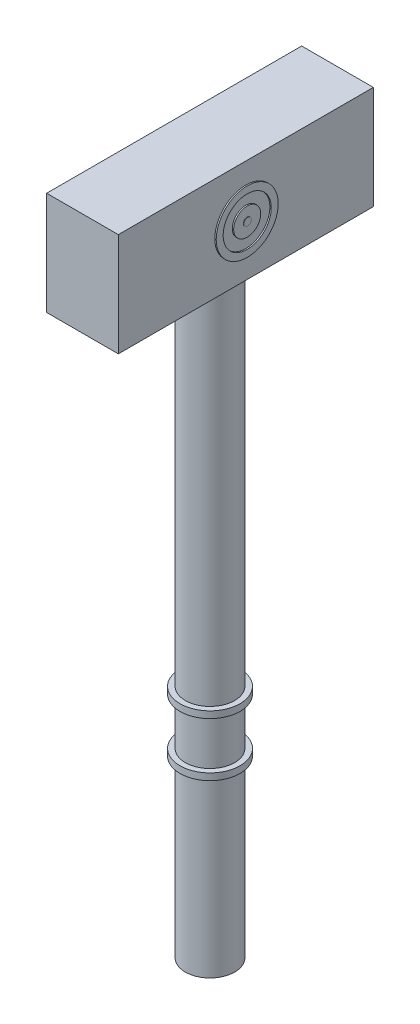
ISO-10303-21;
HEADER;
FILE_DESCRIPTION(('STEP AP214'),'2;1');
FILE_NAME('part.step','',(''),(''),'','','');
FILE_SCHEMA(('AUTOMOTIVE_DESIGN { 1 0 10303 214 1 1 1 1 }'));
ENDSEC;
DATA;
#1=APPLICATION_CONTEXT('core data for automotive mechanical design processes');
#2=APPLICATION_PROTOCOL_DEFINITION('international standard','automotive_design',2000,#1);
#3=PRODUCT_CONTEXT('',#1,'mechanical');
#4=PRODUCT('Part','Part','',(#3));
#5=PRODUCT_RELATED_PRODUCT_CATEGORY('part','',(#4));
#6=PRODUCT_DEFINITION_FORMATION('','',#4);
#7=PRODUCT_DEFINITION_CONTEXT('part definition',#1,'design');
#8=PRODUCT_DEFINITION('design','',#6,#7);
#9=PRODUCT_DEFINITION_SHAPE('','',#8);
#10=(LENGTH_UNIT() NAMED_UNIT(*) SI_UNIT(.MILLI.,.METRE.));
#11=(NAMED_UNIT(*) PLANE_ANGLE_UNIT() SI_UNIT($,.RADIAN.));
#12=(NAMED_UNIT(*) SI_UNIT($,.STERADIAN.) SOLID_ANGLE_UNIT());
#13=UNCERTAINTY_MEASURE_WITH_UNIT(LENGTH_MEASURE(1.E-05),#10,'distance_accuracy_value','');
#14=(GEOMETRIC_REPRESENTATION_CONTEXT(3) GLOBAL_UNCERTAINTY_ASSIGNED_CONTEXT((#13)) GLOBAL_UNIT_ASSIGNED_CONTEXT((#10,
#11,#12)) REPRESENTATION_CONTEXT('',''));
#15=CARTESIAN_POINT('',(0.,0.,0.));
#16=DIRECTION('',(0.,0.,1.));
#17=DIRECTION('',(1.,0.,0.));
#18=AXIS2_PLACEMENT_3D('',#15,#16,#17);
#19=CARTESIAN_POINT('',(0.,91.,0.));
#20=DIRECTION('',(0.,-1.,0.));
#21=DIRECTION('',(0.,0.,-1.));
#22=AXIS2_PLACEMENT_3D('',#19,#20,#21);
#23=CYLINDRICAL_SURFACE('',#22,3.675);
#24=CARTESIAN_POINT('',(0.,28.0000000004,0.));
#25=DIRECTION('',(0.,1.,0.));
#26=DIRECTION('',(0.,0.,1.));
#27=AXIS2_PLACEMENT_3D('',#24,#25,#26);
#28=CIRCLE('',#27,3.675);
#29=CARTESIAN_POINT('',(0.,28.0000000004,3.675));
#30=VERTEX_POINT('',#29);
#31=EDGE_CURVE('E122',#30,#30,#28,.T.);
#32=ORIENTED_EDGE('',*,*,#31,.T.);
#33=EDGE_LOOP('',(#32));
#34=FACE_BOUND('',#33,.T.);
#35=CARTESIAN_POINT('',(0.,35.0000000004,0.));
#36=DIRECTION('',(0.,1.,0.));
#37=DIRECTION('',(0.,0.,1.));
#38=AXIS2_PLACEMENT_3D('',#35,#36,#37);
#39=CIRCLE('',#38,3.675);
#40=CARTESIAN_POINT('',(0.,35.0000000004,3.675));
#41=VERTEX_POINT('',#40);
#42=EDGE_CURVE('E147',#41,#41,#39,.T.);
#43=ORIENTED_EDGE('',*,*,#42,.F.);
#44=EDGE_LOOP('',(#43));
#45=FACE_BOUND('',#44,.T.);
#46=ADVANCED_FACE('F34',(#34,#45),#23,.T.);
#47=CARTESIAN_POINT('',(0.,1.,0.));
#48=DIRECTION('',(0.,1.,0.));
#49=DIRECTION('',(0.,0.,1.));
#50=AXIS2_PLACEMENT_3D('',#47,#48,#49);
#51=CIRCLE('',#50,3.675);
#52=CARTESIAN_POINT('',(0.,1.,3.675));
#53=VERTEX_POINT('',#52);
#54=EDGE_CURVE('E138',#53,#53,#51,.T.);
#55=ORIENTED_EDGE('',*,*,#54,.T.);
#56=EDGE_LOOP('',(#55));
#57=FACE_BOUND('',#56,.T.);
#58=CARTESIAN_POINT('',(0.,27.0000000004,0.));
#59=DIRECTION('',(0.,1.,0.));
#60=DIRECTION('',(0.,0.,1.));
#61=AXIS2_PLACEMENT_3D('',#58,#59,#60);
#62=CIRCLE('',#61,3.675);
#63=CARTESIAN_POINT('',(0.,27.0000000004,3.675));
#64=VERTEX_POINT('',#63);
#65=EDGE_CURVE('E142',#64,#64,#62,.T.);
#66=ORIENTED_EDGE('',*,*,#65,.F.);
#67=EDGE_LOOP('',(#66));
#68=FACE_BOUND('',#67,.T.);
#69=ADVANCED_FACE('F179',(#57,#68),#23,.T.);
#70=CARTESIAN_POINT('',(0.,1.,0.));
#71=DIRECTION('',(0.,1.,0.));
#72=DIRECTION('',(0.,0.,1.));
#73=AXIS2_PLACEMENT_3D('',#70,#71,#72);
#74=PLANE('',#73);
#75=ORIENTED_EDGE('',*,*,#54,.F.);
#76=EDGE_LOOP('',(#75));
#77=FACE_BOUND('',#76,.T.);
#78=CARTESIAN_POINT('',(0.,1.,0.));
#79=DIRECTION('',(0.,1.,0.));
#80=DIRECTION('',(0.,0.,1.));
#81=AXIS2_PLACEMENT_3D('',#78,#79,#80);
#82=CIRCLE('',#81,3.175);
#83=CARTESIAN_POINT('',(0.,1.,3.175));
#84=VERTEX_POINT('',#83);
#85=EDGE_CURVE('E131',#84,#84,#82,.T.);
#86=ORIENTED_EDGE('',*,*,#85,.T.);
#87=EDGE_LOOP('',(#86));
#88=FACE_BOUND('',#87,.T.);
#89=ADVANCED_FACE('F184',(#77,#88),#74,.F.);
#90=CARTESIAN_POINT('',(0.,36.0000000004,0.));
#91=DIRECTION('',(0.,1.,0.));
#92=DIRECTION('',(0.,0.,1.));
#93=AXIS2_PLACEMENT_3D('',#90,#91,#92);
#94=CIRCLE('',#93,3.675);
#95=CARTESIAN_POINT('',(0.,36.0000000004,3.675));
#96=VERTEX_POINT('',#95);
#97=EDGE_CURVE('E115',#96,#96,#94,.T.);
#98=ORIENTED_EDGE('',*,*,#97,.T.);
#99=EDGE_LOOP('',(#98));
#100=FACE_BOUND('',#99,.T.);
#101=CARTESIAN_POINT('',(0.,91.,0.));
#102=DIRECTION('',(0.,1.,0.));
#103=DIRECTION('',(0.,0.,1.));
#104=AXIS2_PLACEMENT_3D('',#101,#102,#103);
#105=CIRCLE('',#104,3.675);
#106=CARTESIAN_POINT('',(0.,91.,3.675));
#107=VERTEX_POINT('',#106);
#108=EDGE_CURVE('E139',#107,#107,#105,.T.);
#109=ORIENTED_EDGE('',*,*,#108,.F.);
#110=EDGE_LOOP('',(#109));
#111=FACE_BOUND('',#110,.T.);
#112=ADVANCED_FACE('F36',(#100,#111),#23,.T.);
#113=CARTESIAN_POINT('',(0.,91.,0.));
#114=DIRECTION('',(0.,-1.,0.));
#115=DIRECTION('',(0.,0.,-1.));
#116=AXIS2_PLACEMENT_3D('',#113,#114,#115);
#117=CYLINDRICAL_SURFACE('',#116,3.175);
#118=CARTESIAN_POINT('',(0.,91.,0.));
#119=DIRECTION('',(0.,1.,0.));
#120=DIRECTION('',(0.,0.,1.));
#121=AXIS2_PLACEMENT_3D('',#118,#119,#120);
#122=CIRCLE('',#121,3.175);
#123=CARTESIAN_POINT('',(0.,91.,3.175));
#124=VERTEX_POINT('',#123);
#125=EDGE_CURVE('E114',#124,#124,#122,.T.);
#126=ORIENTED_EDGE('',*,*,#125,.T.);
#127=EDGE_LOOP('',(#126));
#128=FACE_BOUND('',#127,.T.);
#129=ORIENTED_EDGE('',*,*,#85,.F.);
#130=EDGE_LOOP('',(#129));
#131=FACE_BOUND('',#130,.T.);
#132=ADVANCED_FACE('F188',(#128,#131),#117,.F.);
#133=CARTESIAN_POINT('',(0.,27.0000000004,0.));
#134=DIRECTION('',(0.,1.,0.));
#135=DIRECTION('',(0.,0.,1.));
#136=AXIS2_PLACEMENT_3D('',#133,#134,#135);
#137=CYLINDRICAL_SURFACE('',#136,4.475);
#138=CARTESIAN_POINT('',(0.,27.0000000004,0.));
#139=DIRECTION('',(0.,1.,0.));
#140=DIRECTION('',(0.,0.,1.));
#141=AXIS2_PLACEMENT_3D('',#138,#139,#140);
#142=CIRCLE('',#141,4.475);
#143=CARTESIAN_POINT('',(0.,27.0000000004,4.475));
#144=VERTEX_POINT('',#143);
#145=EDGE_CURVE('E128',#144,#144,#142,.T.);
#146=ORIENTED_EDGE('',*,*,#145,.T.);
#147=EDGE_LOOP('',(#146));
#148=FACE_BOUND('',#147,.T.);
#149=CARTESIAN_POINT('',(0.,28.0000000004,0.));
#150=DIRECTION('',(0.,1.,0.));
#151=DIRECTION('',(0.,0.,1.));
#152=AXIS2_PLACEMENT_3D('',#149,#150,#151);
#153=CIRCLE('',#152,4.475);
#154=CARTESIAN_POINT('',(0.,28.0000000004,4.475));
#155=VERTEX_POINT('',#154);
#156=EDGE_CURVE('E127',#155,#155,#153,.T.);
#157=ORIENTED_EDGE('',*,*,#156,.F.);
#158=EDGE_LOOP('',(#157));
#159=FACE_BOUND('',#158,.T.);
#160=ADVANCED_FACE('F194',(#148,#159),#137,.T.);
#161=CARTESIAN_POINT('',(0.,27.0000000004,0.));
#162=DIRECTION('',(0.,1.,0.));
#163=DIRECTION('',(0.,0.,1.));
#164=AXIS2_PLACEMENT_3D('',#161,#162,#163);
#165=PLANE('',#164);
#166=ORIENTED_EDGE('',*,*,#65,.T.);
#167=EDGE_LOOP('',(#166));
#168=FACE_BOUND('',#167,.T.);
#169=ORIENTED_EDGE('',*,*,#145,.F.);
#170=EDGE_LOOP('',(#169));
#171=FACE_BOUND('',#170,.T.);
#172=ADVANCED_FACE('F224',(#168,#171),#165,.F.);
#173=CARTESIAN_POINT('',(0.,28.0000000004,0.));
#174=DIRECTION('',(0.,1.,0.));
#175=DIRECTION('',(0.,0.,1.));
#176=AXIS2_PLACEMENT_3D('',#173,#174,#175);
#177=PLANE('',#176);
#178=ORIENTED_EDGE('',*,*,#31,.F.);
#179=EDGE_LOOP('',(#178));
#180=FACE_BOUND('',#179,.T.);
#181=ORIENTED_EDGE('',*,*,#156,.T.);
#182=EDGE_LOOP('',(#181));
#183=FACE_BOUND('',#182,.T.);
#184=ADVANCED_FACE('F222',(#180,#183),#177,.T.);
#185=CARTESIAN_POINT('',(0.,35.0000000004,0.));
#186=DIRECTION('',(0.,1.,0.));
#187=DIRECTION('',(0.,0.,1.));
#188=AXIS2_PLACEMENT_3D('',#185,#186,#187);
#189=CYLINDRICAL_SURFACE('',#188,4.475);
#190=CARTESIAN_POINT('',(0.,35.0000000004,0.));
#191=DIRECTION('',(0.,1.,0.));
#192=DIRECTION('',(0.,0.,1.));
#193=AXIS2_PLACEMENT_3D('',#190,#191,#192);
#194=CIRCLE('',#193,4.475);
#195=CARTESIAN_POINT('',(0.,35.0000000004,4.475));
#196=VERTEX_POINT('',#195);
#197=EDGE_CURVE('E119',#196,#196,#194,.T.);
#198=ORIENTED_EDGE('',*,*,#197,.T.);
#199=EDGE_LOOP('',(#198));
#200=FACE_BOUND('',#199,.T.);
#201=CARTESIAN_POINT('',(0.,36.0000000004,0.));
#202=DIRECTION('',(0.,1.,0.));
#203=DIRECTION('',(0.,0.,1.));
#204=AXIS2_PLACEMENT_3D('',#201,#202,#203);
#205=CIRCLE('',#204,4.475);
#206=CARTESIAN_POINT('',(0.,36.0000000004,4.475));
#207=VERTEX_POINT('',#206);
#208=EDGE_CURVE('E118',#207,#207,#205,.T.);
#209=ORIENTED_EDGE('',*,*,#208,.F.);
#210=EDGE_LOOP('',(#209));
#211=FACE_BOUND('',#210,.T.);
#212=ADVANCED_FACE('F215',(#200,#211),#189,.T.);
#213=CARTESIAN_POINT('',(0.,35.0000000004,0.));
#214=DIRECTION('',(0.,1.,0.));
#215=DIRECTION('',(0.,0.,1.));
#216=AXIS2_PLACEMENT_3D('',#213,#214,#215);
#217=PLANE('',#216);
#218=ORIENTED_EDGE('',*,*,#42,.T.);
#219=EDGE_LOOP('',(#218));
#220=FACE_BOUND('',#219,.T.);
#221=ORIENTED_EDGE('',*,*,#197,.F.);
#222=EDGE_LOOP('',(#221));
#223=FACE_BOUND('',#222,.T.);
#224=ADVANCED_FACE('F211',(#220,#223),#217,.F.);
#225=CARTESIAN_POINT('',(0.,36.0000000004,0.));
#226=DIRECTION('',(0.,1.,0.));
#227=DIRECTION('',(0.,0.,1.));
#228=AXIS2_PLACEMENT_3D('',#225,#226,#227);
#229=PLANE('',#228);
#230=ORIENTED_EDGE('',*,*,#97,.F.);
#231=EDGE_LOOP('',(#230));
#232=FACE_BOUND('',#231,.T.);
#233=ORIENTED_EDGE('',*,*,#208,.T.);
#234=EDGE_LOOP('',(#233));
#235=FACE_BOUND('',#234,.T.);
#236=ADVANCED_FACE('F214',(#232,#235),#229,.T.);
#237=CARTESIAN_POINT('',(5.334,91.,3.675));
#238=DIRECTION('',(0.,1.,0.));
#239=DIRECTION('',(0.,0.,1.));
#240=AXIS2_PLACEMENT_3D('',#237,#238,#239);
#241=PLANE('',#240);
#242=ORIENTED_EDGE('',*,*,#125,.F.);
#243=EDGE_LOOP('',(#242));
#244=FACE_BOUND('',#243,.T.);
#245=ADVANCED_FACE('F172',(#244),#241,.F.);
#246=CARTESIAN_POINT('',(5.334,106.374648480065,-18.9768574018018));
#247=DIRECTION('',(0.,0.,1.));
#248=DIRECTION('',(1.,0.,0.));
#249=AXIS2_PLACEMENT_3D('',#246,#247,#248);
#250=PLANE('',#249);
#251=DIRECTION('',(0.,1.,0.));
#252=VECTOR('',#251,1.);
#253=CARTESIAN_POINT('',(-5.334,106.374648480065,-18.9768574018018));
#254=LINE('',#253,#252);
#255=CARTESIAN_POINT('',(-5.334,91.,-18.9768574018018));
#256=VERTEX_POINT('',#255);
#257=CARTESIAN_POINT('',(-5.334,106.374648480065,-18.9768574018018));
#258=VERTEX_POINT('',#257);
#259=EDGE_CURVE('E93',#256,#258,#254,.T.);
#260=ORIENTED_EDGE('',*,*,#259,.T.);
#261=DIRECTION('',(-1.,0.,0.));
#262=VECTOR('',#261,1.);
#263=CARTESIAN_POINT('',(5.334,106.374648480065,-18.9768574018018));
#264=LINE('',#263,#262);
#265=CARTESIAN_POINT('',(5.334,106.374648480065,-18.9768574018018));
#266=VERTEX_POINT('',#265);
#267=EDGE_CURVE('E90',#266,#258,#264,.T.);
#268=ORIENTED_EDGE('',*,*,#267,.F.);
#269=DIRECTION('',(0.,1.,0.));
#270=VECTOR('',#269,1.);
#271=CARTESIAN_POINT('',(5.334,106.374648480065,-18.9768574018018));
#272=LINE('',#271,#270);
#273=CARTESIAN_POINT('',(5.334,91.,-18.9768574018018));
#274=VERTEX_POINT('',#273);
#275=EDGE_CURVE('E82',#274,#266,#272,.T.);
#276=ORIENTED_EDGE('',*,*,#275,.F.);
#277=DIRECTION('',(-1.,0.,0.));
#278=VECTOR('',#277,1.);
#279=CARTESIAN_POINT('',(5.334,91.,-18.9768574018018));
#280=LINE('',#279,#278);
#281=EDGE_CURVE('E94',#274,#256,#280,.T.);
#282=ORIENTED_EDGE('',*,*,#281,.T.);
#283=EDGE_LOOP('',(#260,#268,#276,#282));
#284=FACE_BOUND('',#283,.T.);
#285=ADVANCED_FACE('F91',(#284),#250,.F.);
#286=CARTESIAN_POINT('',(5.334,106.374648480065,18.9768574018018));
#287=DIRECTION('',(0.,-1.,0.));
#288=DIRECTION('',(0.,0.,-1.));
#289=AXIS2_PLACEMENT_3D('',#286,#287,#288);
#290=PLANE('',#289);
#291=DIRECTION('',(0.,0.,1.));
#292=VECTOR('',#291,1.);
#293=CARTESIAN_POINT('',(-5.334,106.374648480065,18.9768574018018));
#294=LINE('',#293,#292);
#295=CARTESIAN_POINT('',(-5.334,106.374648480065,18.9768574018018));
#296=VERTEX_POINT('',#295);
#297=EDGE_CURVE('E70',#258,#296,#294,.T.);
#298=ORIENTED_EDGE('',*,*,#297,.T.);
#299=DIRECTION('',(-1.,0.,0.));
#300=VECTOR('',#299,1.);
#301=CARTESIAN_POINT('',(5.334,106.374648480065,18.9768574018018));
#302=LINE('',#301,#300);
#303=CARTESIAN_POINT('',(5.334,106.374648480065,18.9768574018018));
#304=VERTEX_POINT('',#303);
#305=EDGE_CURVE('E95',#304,#296,#302,.T.);
#306=ORIENTED_EDGE('',*,*,#305,.F.);
#307=DIRECTION('',(0.,0.,1.));
#308=VECTOR('',#307,1.);
#309=CARTESIAN_POINT('',(5.334,106.374648480065,18.9768574018018));
#310=LINE('',#309,#308);
#311=EDGE_CURVE('E86',#266,#304,#310,.T.);
#312=ORIENTED_EDGE('',*,*,#311,.F.);
#313=ORIENTED_EDGE('',*,*,#267,.T.);
#314=EDGE_LOOP('',(#298,#306,#312,#313));
#315=FACE_BOUND('',#314,.T.);
#316=ADVANCED_FACE('F97',(#315),#290,.F.);
#317=CARTESIAN_POINT('',(5.334,91.,18.9768574018018));
#318=DIRECTION('',(0.,0.,-1.));
#319=DIRECTION('',(-1.,0.,0.));
#320=AXIS2_PLACEMENT_3D('',#317,#318,#319);
#321=PLANE('',#320);
#322=DIRECTION('',(0.,-1.,0.));
#323=VECTOR('',#322,1.);
#324=CARTESIAN_POINT('',(-5.334,91.,18.9768574018018));
#325=LINE('',#324,#323);
#326=CARTESIAN_POINT('',(-5.334,91.,18.9768574018018));
#327=VERTEX_POINT('',#326);
#328=EDGE_CURVE('E77',#296,#327,#325,.T.);
#329=ORIENTED_EDGE('',*,*,#328,.T.);
#330=DIRECTION('',(-1.,0.,0.));
#331=VECTOR('',#330,1.);
#332=CARTESIAN_POINT('',(5.334,91.,18.9768574018018));
#333=LINE('',#332,#331);
#334=CARTESIAN_POINT('',(5.334,91.,18.9768574018018));
#335=VERTEX_POINT('',#334);
#336=EDGE_CURVE('E101',#335,#327,#333,.T.);
#337=ORIENTED_EDGE('',*,*,#336,.F.);
#338=DIRECTION('',(0.,-1.,0.));
#339=VECTOR('',#338,1.);
#340=CARTESIAN_POINT('',(5.334,91.,18.9768574018018));
#341=LINE('',#340,#339);
#342=EDGE_CURVE('E99',#304,#335,#341,.T.);
#343=ORIENTED_EDGE('',*,*,#342,.F.);
#344=ORIENTED_EDGE('',*,*,#305,.T.);
#345=EDGE_LOOP('',(#329,#337,#343,#344));
#346=FACE_BOUND('',#345,.T.);
#347=ADVANCED_FACE('F169',(#346),#321,.F.);
#348=ORIENTED_EDGE('',*,*,#108,.T.);
#349=EDGE_LOOP('',(#348));
#350=FACE_BOUND('',#349,.T.);
#351=DIRECTION('',(0.,0.,-1.));
#352=VECTOR('',#351,1.);
#353=CARTESIAN_POINT('',(-5.334,91.,3.675));
#354=LINE('',#353,#352);
#355=EDGE_CURVE('E109',#327,#256,#354,.T.);
#356=ORIENTED_EDGE('',*,*,#355,.T.);
#357=ORIENTED_EDGE('',*,*,#281,.F.);
#358=DIRECTION('',(0.,0.,-1.));
#359=VECTOR('',#358,1.);
#360=CARTESIAN_POINT('',(5.334,91.,3.675));
#361=LINE('',#360,#359);
#362=EDGE_CURVE('E52',#335,#274,#361,.T.);
#363=ORIENTED_EDGE('',*,*,#362,.F.);
#364=ORIENTED_EDGE('',*,*,#336,.T.);
#365=EDGE_LOOP('',(#356,#357,#363,#364));
#366=FACE_BOUND('',#365,.T.);
#367=ADVANCED_FACE('F160',(#350,#366),#241,.F.);
#368=CARTESIAN_POINT('',(5.334,0.,0.));
#369=DIRECTION('',(-1.,0.,0.));
#370=DIRECTION('',(0.,0.,1.));
#371=AXIS2_PLACEMENT_3D('',#368,#369,#370);
#372=PLANE('',#371);
#373=CARTESIAN_POINT('',(5.334,98.6650763520631,0.));
#374=DIRECTION('',(-1.,0.,0.));
#375=DIRECTION('',(0.,0.,1.));
#376=AXIS2_PLACEMENT_3D('',#373,#374,#375);
#377=CIRCLE('',#376,4.6138276774854);
#378=CARTESIAN_POINT('',(5.334,98.6650763520631,4.6138276774854));
#379=VERTEX_POINT('',#378);
#380=EDGE_CURVE('E44',#379,#379,#377,.F.);
#381=ORIENTED_EDGE('',*,*,#380,.F.);
#382=EDGE_LOOP('',(#381));
#383=FACE_BOUND('',#382,.T.);
#384=ORIENTED_EDGE('',*,*,#362,.T.);
#385=ORIENTED_EDGE('',*,*,#275,.T.);
#386=ORIENTED_EDGE('',*,*,#311,.T.);
#387=ORIENTED_EDGE('',*,*,#342,.T.);
#388=EDGE_LOOP('',(#384,#385,#386,#387));
#389=FACE_BOUND('',#388,.T.);
#390=ADVANCED_FACE('F84',(#383,#389),#372,.F.);
#391=CARTESIAN_POINT('',(-5.334,0.,0.));
#392=DIRECTION('',(-1.,0.,0.));
#393=DIRECTION('',(0.,0.,1.));
#394=AXIS2_PLACEMENT_3D('',#391,#392,#393);
#395=PLANE('',#394);
#396=ORIENTED_EDGE('',*,*,#259,.F.);
#397=ORIENTED_EDGE('',*,*,#355,.F.);
#398=ORIENTED_EDGE('',*,*,#328,.F.);
#399=ORIENTED_EDGE('',*,*,#297,.F.);
#400=EDGE_LOOP('',(#396,#397,#398,#399));
#401=FACE_BOUND('',#400,.T.);
#402=ADVANCED_FACE('F159',(#401),#395,.T.);
#403=CARTESIAN_POINT('',(5.5372,98.6650763520631,0.));
#404=DIRECTION('',(-1.,0.,0.));
#405=DIRECTION('',(0.,0.,1.));
#406=AXIS2_PLACEMENT_3D('',#403,#404,#405);
#407=CYLINDRICAL_SURFACE('',#406,4.6138276774854);
#408=CARTESIAN_POINT('',(5.5372,98.6650763520631,0.));
#409=DIRECTION('',(1.,0.,0.));
#410=DIRECTION('',(0.,0.,-1.));
#411=AXIS2_PLACEMENT_3D('',#408,#409,#410);
#412=CIRCLE('',#411,4.6138276774854);
#413=CARTESIAN_POINT('',(5.5372,98.6650763520631,-4.6138276774854));
#414=VERTEX_POINT('',#413);
#415=EDGE_CURVE('E152',#414,#414,#412,.T.);
#416=ORIENTED_EDGE('',*,*,#415,.F.);
#417=EDGE_LOOP('',(#416));
#418=FACE_BOUND('',#417,.T.);
#419=ORIENTED_EDGE('',*,*,#380,.T.);
#420=EDGE_LOOP('',(#419));
#421=FACE_BOUND('',#420,.T.);
#422=ADVANCED_FACE('F156',(#418,#421),#407,.T.);
#423=CARTESIAN_POINT('',(5.5372,98.6650763520631,0.));
#424=DIRECTION('',(-1.,0.,0.));
#425=DIRECTION('',(0.,0.,1.));
#426=AXIS2_PLACEMENT_3D('',#423,#424,#425);
#427=CYLINDRICAL_SURFACE('',#426,3.58020491514313);
#428=CARTESIAN_POINT('',(5.5372,98.6650763520631,0.));
#429=DIRECTION('',(1.,0.,0.));
#430=DIRECTION('',(0.,0.,-1.));
#431=AXIS2_PLACEMENT_3D('',#428,#429,#430);
#432=CIRCLE('',#431,3.58020491514313);
#433=CARTESIAN_POINT('',(5.5372,98.6650763520631,-3.58020491514313));
#434=VERTEX_POINT('',#433);
#435=EDGE_CURVE('E387',#434,#434,#432,.T.);
#436=ORIENTED_EDGE('',*,*,#435,.T.);
#437=EDGE_LOOP('',(#436));
#438=FACE_BOUND('',#437,.T.);
#439=CARTESIAN_POINT('',(5.334,98.6650763520631,0.));
#440=DIRECTION('',(-1.,0.,0.));
#441=DIRECTION('',(0.,0.,1.));
#442=AXIS2_PLACEMENT_3D('',#439,#440,#441);
#443=CIRCLE('',#442,3.58020491514313);
#444=CARTESIAN_POINT('',(5.334,98.6650763520631,3.58020491514313));
#445=VERTEX_POINT('',#444);
#446=EDGE_CURVE('E106',#445,#445,#443,.F.);
#447=ORIENTED_EDGE('',*,*,#446,.F.);
#448=EDGE_LOOP('',(#447));
#449=FACE_BOUND('',#448,.T.);
#450=ADVANCED_FACE('F308',(#438,#449),#427,.F.);
#451=CARTESIAN_POINT('',(5.5372,98.6650763520631,0.));
#452=DIRECTION('',(1.,0.,0.));
#453=DIRECTION('',(0.,0.,-1.));
#454=AXIS2_PLACEMENT_3D('',#451,#452,#453);
#455=PLANE('',#454);
#456=ORIENTED_EDGE('',*,*,#415,.T.);
#457=EDGE_LOOP('',(#456));
#458=FACE_BOUND('',#457,.T.);
#459=ORIENTED_EDGE('',*,*,#435,.F.);
#460=EDGE_LOOP('',(#459));
#461=FACE_BOUND('',#460,.T.);
#462=ADVANCED_FACE('F176',(#458,#461),#455,.T.);
#463=CARTESIAN_POINT('',(5.334,98.6650763520631,0.));
#464=DIRECTION('',(-1.,0.,0.));
#465=DIRECTION('',(0.,0.,1.));
#466=AXIS2_PLACEMENT_3D('',#463,#464,#465);
#467=CIRCLE('',#466,2.01434010798083);
#468=CARTESIAN_POINT('',(5.334,98.6650763520631,2.01434010798083));
#469=VERTEX_POINT('',#468);
#470=EDGE_CURVE('E11',#469,#469,#467,.F.);
#471=ORIENTED_EDGE('',*,*,#470,.F.);
#472=EDGE_LOOP('',(#471));
#473=FACE_BOUND('',#472,.T.);
#474=ORIENTED_EDGE('',*,*,#446,.T.);
#475=EDGE_LOOP('',(#474));
#476=FACE_BOUND('',#475,.T.);
#477=ADVANCED_FACE('F162',(#473,#476),#372,.F.);
#478=CARTESIAN_POINT('',(5.5372,98.6650763520631,0.));
#479=DIRECTION('',(-1.,0.,0.));
#480=DIRECTION('',(0.,0.,1.));
#481=AXIS2_PLACEMENT_3D('',#478,#479,#480);
#482=CYLINDRICAL_SURFACE('',#481,2.01434010798083);
#483=CARTESIAN_POINT('',(5.5372,98.6650763520631,0.));
#484=DIRECTION('',(1.,0.,0.));
#485=DIRECTION('',(0.,0.,-1.));
#486=AXIS2_PLACEMENT_3D('',#483,#484,#485);
#487=CIRCLE('',#486,2.01434010798083);
#488=CARTESIAN_POINT('',(5.5372,98.6650763520631,-2.01434010798083));
#489=VERTEX_POINT('',#488);
#490=EDGE_CURVE('E383',#489,#489,#487,.T.);
#491=ORIENTED_EDGE('',*,*,#490,.F.);
#492=EDGE_LOOP('',(#491));
#493=FACE_BOUND('',#492,.T.);
#494=ORIENTED_EDGE('',*,*,#470,.T.);
#495=EDGE_LOOP('',(#494));
#496=FACE_BOUND('',#495,.T.);
#497=ADVANCED_FACE('F175',(#493,#496),#482,.T.);
#498=CARTESIAN_POINT('',(5.5372,98.6650763520631,0.));
#499=DIRECTION('',(1.,0.,0.));
#500=DIRECTION('',(0.,0.,-1.));
#501=AXIS2_PLACEMENT_3D('',#498,#499,#500);
#502=PLANE('',#501);
#503=CARTESIAN_POINT('',(5.5372,98.6650763520631,0.));
#504=DIRECTION('',(1.,0.,0.));
#505=DIRECTION('',(0.,0.,-1.));
#506=AXIS2_PLACEMENT_3D('',#503,#504,#505);
#507=CIRCLE('',#506,0.566328477771696);
#508=CARTESIAN_POINT('',(5.5372,98.6650763520631,-0.566328477771696));
#509=VERTEX_POINT('',#508);
#510=EDGE_CURVE('E38',#509,#509,#507,.F.);
#511=ORIENTED_EDGE('',*,*,#510,.T.);
#512=EDGE_LOOP('',(#511));
#513=FACE_BOUND('',#512,.T.);
#514=ORIENTED_EDGE('',*,*,#490,.T.);
#515=EDGE_LOOP('',(#514));
#516=FACE_BOUND('',#515,.T.);
#517=ADVANCED_FACE('F341',(#513,#516),#502,.T.);
#518=CARTESIAN_POINT('',(5.588,98.6650763520631,0.));
#519=DIRECTION('',(-1.,0.,0.));
#520=DIRECTION('',(0.,0.,1.));
#521=AXIS2_PLACEMENT_3D('',#518,#519,#520);
#522=CYLINDRICAL_SURFACE('',#521,0.566328477771696);
#523=ORIENTED_EDGE('',*,*,#510,.F.);
#524=EDGE_LOOP('',(#523));
#525=FACE_BOUND('',#524,.T.);
#526=CARTESIAN_POINT('',(5.588,98.6650763520631,0.));
#527=DIRECTION('',(1.,0.,0.));
#528=DIRECTION('',(0.,0.,-1.));
#529=AXIS2_PLACEMENT_3D('',#526,#527,#528);
#530=CIRCLE('',#529,0.566328477771696);
#531=CARTESIAN_POINT('',(5.588,98.6650763520631,-0.566328477771696));
#532=VERTEX_POINT('',#531);
#533=EDGE_CURVE('E379',#532,#532,#530,.T.);
#534=ORIENTED_EDGE('',*,*,#533,.F.);
#535=EDGE_LOOP('',(#534));
#536=FACE_BOUND('',#535,.T.);
#537=ADVANCED_FACE('F352',(#525,#536),#522,.T.);
#538=CARTESIAN_POINT('',(5.588,98.6650763520631,0.));
#539=DIRECTION('',(1.,0.,0.));
#540=DIRECTION('',(0.,0.,-1.));
#541=AXIS2_PLACEMENT_3D('',#538,#539,#540);
#542=PLANE('',#541);
#543=ORIENTED_EDGE('',*,*,#533,.T.);
#544=EDGE_LOOP('',(#543));
#545=FACE_BOUND('',#544,.T.);
#546=ADVANCED_FACE('F362',(#545),#542,.T.);
#547=CLOSED_SHELL('',(#46,#69,#89,#112,#132,#160,#172,#184,#212,#224,#236,#245,#285,#316,#347,
#367,#390,#402,#422,#450,#462,#477,#497,#517,#537,#546));
#548=MANIFOLD_SOLID_BREP('B2',#547);
#549=ADVANCED_BREP_SHAPE_REPRESENTATION('',(#18,#548),#14);
#550=SHAPE_DEFINITION_REPRESENTATION(#9,#549);
ENDSEC;
END-ISO-10303-21;
